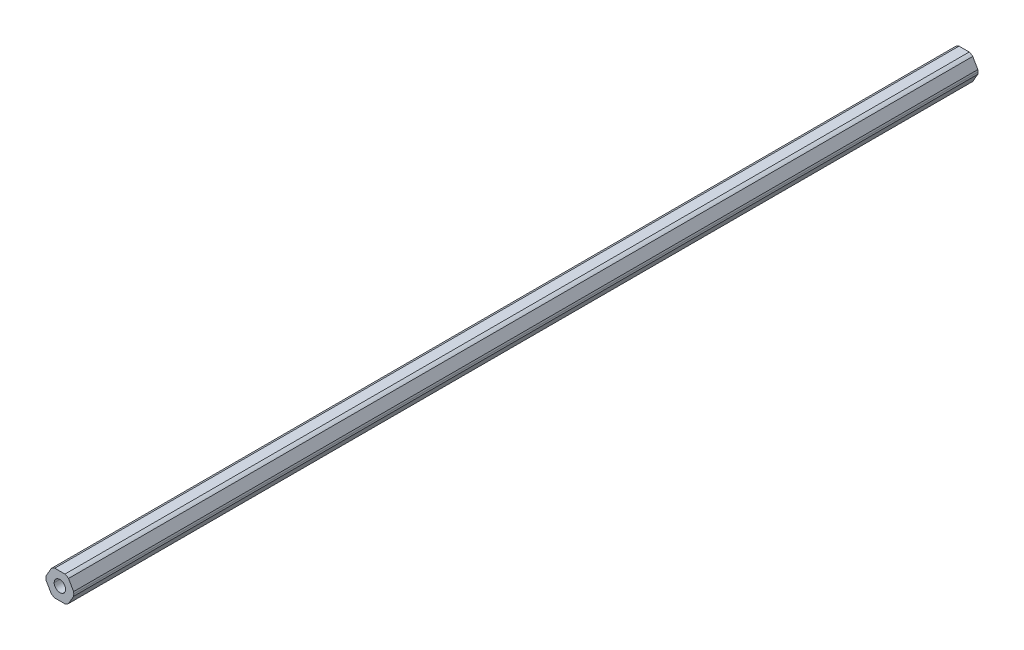
ISO-10303-21;
HEADER;
FILE_DESCRIPTION(('STEP AP214'),'2;1');
FILE_NAME('part.step','',(''),(''),'','','');
FILE_SCHEMA(('AUTOMOTIVE_DESIGN { 1 0 10303 214 1 1 1 1 }'));
ENDSEC;
DATA;
#1=APPLICATION_CONTEXT('core data for automotive mechanical design processes');
#2=APPLICATION_PROTOCOL_DEFINITION('international standard','automotive_design',2000,#1);
#3=PRODUCT_CONTEXT('',#1,'mechanical');
#4=PRODUCT('Part','Part','',(#3));
#5=PRODUCT_RELATED_PRODUCT_CATEGORY('part','',(#4));
#6=PRODUCT_DEFINITION_FORMATION('','',#4);
#7=PRODUCT_DEFINITION_CONTEXT('part definition',#1,'design');
#8=PRODUCT_DEFINITION('design','',#6,#7);
#9=PRODUCT_DEFINITION_SHAPE('','',#8);
#10=(LENGTH_UNIT() NAMED_UNIT(*) SI_UNIT(.MILLI.,.METRE.));
#11=(NAMED_UNIT(*) PLANE_ANGLE_UNIT() SI_UNIT($,.RADIAN.));
#12=(NAMED_UNIT(*) SI_UNIT($,.STERADIAN.) SOLID_ANGLE_UNIT());
#13=UNCERTAINTY_MEASURE_WITH_UNIT(LENGTH_MEASURE(1.E-05),#10,'distance_accuracy_value','');
#14=(GEOMETRIC_REPRESENTATION_CONTEXT(3) GLOBAL_UNCERTAINTY_ASSIGNED_CONTEXT((#13)) GLOBAL_UNIT_ASSIGNED_CONTEXT((#10,
#11,#12)) REPRESENTATION_CONTEXT('',''));
#15=CARTESIAN_POINT('',(0.,0.,0.));
#16=DIRECTION('',(0.,0.,1.));
#17=DIRECTION('',(1.,0.,0.));
#18=AXIS2_PLACEMENT_3D('',#15,#16,#17);
#19=CARTESIAN_POINT('',(0.,0.,-457.2));
#20=DIRECTION('',(0.,0.,1.));
#21=DIRECTION('',(1.,0.,0.));
#22=AXIS2_PLACEMENT_3D('',#19,#20,#21);
#23=CYLINDRICAL_SURFACE('',#22,2.1);
#24=CARTESIAN_POINT('',(0.,0.,-123.825));
#25=DIRECTION('',(0.,0.,1.));
#26=DIRECTION('',(1.,0.,0.));
#27=AXIS2_PLACEMENT_3D('',#24,#25,#26);
#28=CIRCLE('',#27,2.1);
#29=CARTESIAN_POINT('',(2.1,0.,-123.825));
#30=VERTEX_POINT('',#29);
#31=CARTESIAN_POINT('',(-2.1,0.,-123.825));
#32=VERTEX_POINT('',#31);
#33=EDGE_CURVE('E75',#30,#32,#28,.F.);
#34=ORIENTED_EDGE('',*,*,#33,.F.);
#35=DIRECTION('',(0.,0.,1.));
#36=VECTOR('',#35,1.);
#37=CARTESIAN_POINT('',(2.1,0.,-457.2));
#38=LINE('',#37,#36);
#39=CARTESIAN_POINT('',(2.1,0.,-457.2));
#40=VERTEX_POINT('',#39);
#41=EDGE_CURVE('E221',#40,#30,#38,.T.);
#42=ORIENTED_EDGE('',*,*,#41,.F.);
#43=CARTESIAN_POINT('',(0.,0.,-457.2));
#44=DIRECTION('',(0.,0.,1.));
#45=DIRECTION('',(1.,0.,0.));
#46=AXIS2_PLACEMENT_3D('',#43,#44,#45);
#47=CIRCLE('',#46,2.1);
#48=CARTESIAN_POINT('',(-2.1,0.,-457.2));
#49=VERTEX_POINT('',#48);
#50=EDGE_CURVE('E201',#49,#40,#47,.T.);
#51=ORIENTED_EDGE('',*,*,#50,.F.);
#52=DIRECTION('',(0.,0.,1.));
#53=VECTOR('',#52,1.);
#54=CARTESIAN_POINT('',(-2.1,0.,-457.2));
#55=LINE('',#54,#53);
#56=EDGE_CURVE('E62',#49,#32,#55,.T.);
#57=ORIENTED_EDGE('',*,*,#56,.T.);
#58=EDGE_LOOP('',(#34,#42,#51,#57));
#59=FACE_BOUND('',#58,.T.);
#60=ADVANCED_FACE('F54',(#59),#23,.F.);
#61=CARTESIAN_POINT('',(0.,0.,-457.2));
#62=DIRECTION('',(0.,0.,1.));
#63=DIRECTION('',(1.,0.,0.));
#64=AXIS2_PLACEMENT_3D('',#61,#62,#63);
#65=CYLINDRICAL_SURFACE('',#64,5.12);
#66=DIRECTION('',(0.,0.,1.));
#67=VECTOR('',#66,1.);
#68=CARTESIAN_POINT('',(5.12,0.,-457.2));
#69=LINE('',#68,#67);
#70=CARTESIAN_POINT('',(5.12,0.,-457.2));
#71=VERTEX_POINT('',#70);
#72=CARTESIAN_POINT('',(5.12,0.,-123.825));
#73=VERTEX_POINT('',#72);
#74=EDGE_CURVE('E237',#71,#73,#69,.T.);
#75=ORIENTED_EDGE('',*,*,#74,.T.);
#76=CARTESIAN_POINT('',(0.,0.,-123.825));
#77=DIRECTION('',(0.,0.,1.));
#78=DIRECTION('',(1.,0.,0.));
#79=AXIS2_PLACEMENT_3D('',#76,#77,#78);
#80=CIRCLE('',#79,5.12);
#81=CARTESIAN_POINT('',(5.06425896558911,-0.753446168913433,-123.825));
#82=VERTEX_POINT('',#81);
#83=EDGE_CURVE('E176',#82,#73,#80,.T.);
#84=ORIENTED_EDGE('',*,*,#83,.F.);
#85=DIRECTION('',(0.,0.,-1.));
#86=VECTOR('',#85,1.);
#87=CARTESIAN_POINT('',(5.06425896558911,-0.753446168913433,-457.2));
#88=LINE('',#87,#86);
#89=CARTESIAN_POINT('',(5.06425896558911,-0.753446168913433,-457.2));
#90=VERTEX_POINT('',#89);
#91=EDGE_CURVE('E240',#82,#90,#88,.T.);
#92=ORIENTED_EDGE('',*,*,#91,.T.);
#93=CARTESIAN_POINT('',(0.,0.,-457.2));
#94=DIRECTION('',(0.,0.,1.));
#95=DIRECTION('',(1.,0.,0.));
#96=AXIS2_PLACEMENT_3D('',#93,#94,#95);
#97=CIRCLE('',#96,5.12);
#98=EDGE_CURVE('E239',#90,#71,#97,.T.);
#99=ORIENTED_EDGE('',*,*,#98,.T.);
#100=EDGE_LOOP('',(#75,#84,#92,#99));
#101=FACE_BOUND('',#100,.T.);
#102=ADVANCED_FACE('F364',(#101),#65,.T.);
#103=CARTESIAN_POINT('',(2.74963065701564,-4.7625,457.2));
#104=DIRECTION('',(-0.866025403784442,0.5,0.));
#105=DIRECTION('',(0.,0.,1.));
#106=AXIS2_PLACEMENT_3D('',#103,#104,#105);
#107=PLANE('',#106);
#108=DIRECTION('',(0.499999999999991,0.866025403784444,0.));
#109=VECTOR('',#108,1.);
#110=CARTESIAN_POINT('',(3.18463300545771,-4.00905383108654,-123.825));
#111=LINE('',#110,#109);
#112=CARTESIAN_POINT('',(3.18463300545771,-4.00905383108654,-123.825));
#113=VERTEX_POINT('',#112);
#114=EDGE_CURVE('E323',#113,#82,#111,.T.);
#115=ORIENTED_EDGE('',*,*,#114,.F.);
#116=DIRECTION('',(0.,0.,1.));
#117=VECTOR('',#116,1.);
#118=CARTESIAN_POINT('',(3.1846330054577,-4.00905383108652,-457.2));
#119=LINE('',#118,#117);
#120=CARTESIAN_POINT('',(3.1846330054577,-4.00905383108652,-457.2));
#121=VERTEX_POINT('',#120);
#122=EDGE_CURVE('E195',#121,#113,#119,.T.);
#123=ORIENTED_EDGE('',*,*,#122,.F.);
#124=DIRECTION('',(0.5,0.866025403784442,0.));
#125=VECTOR('',#124,1.);
#126=CARTESIAN_POINT('',(2.74963065701564,-4.7625,-457.2));
#127=LINE('',#126,#125);
#128=EDGE_CURVE('E250',#121,#90,#127,.T.);
#129=ORIENTED_EDGE('',*,*,#128,.T.);
#130=ORIENTED_EDGE('',*,*,#91,.F.);
#131=EDGE_LOOP('',(#115,#123,#129,#130));
#132=FACE_BOUND('',#131,.T.);
#133=ADVANCED_FACE('F361',(#132),#107,.F.);
#134=CARTESIAN_POINT('',(5.49926131403117,0.,457.2));
#135=DIRECTION('',(-0.866025403784438,-0.5,0.));
#136=DIRECTION('',(-0.5,0.866025403784438,0.));
#137=AXIS2_PLACEMENT_3D('',#134,#135,#136);
#138=PLANE('',#137);
#139=DIRECTION('',(-0.500000000000001,0.866025403784438,0.));
#140=VECTOR('',#139,1.);
#141=CARTESIAN_POINT('',(5.06425896558911,0.753446168913416,-123.825));
#142=LINE('',#141,#140);
#143=CARTESIAN_POINT('',(5.06425896558911,0.753446168913416,-123.825));
#144=VERTEX_POINT('',#143);
#145=CARTESIAN_POINT('',(3.18463300545762,4.00905383108658,-123.825));
#146=VERTEX_POINT('',#145);
#147=EDGE_CURVE('E69',#144,#146,#142,.T.);
#148=ORIENTED_EDGE('',*,*,#147,.F.);
#149=DIRECTION('',(0.,0.,1.));
#150=VECTOR('',#149,1.);
#151=CARTESIAN_POINT('',(5.06425896558911,0.753446168913412,-457.2));
#152=LINE('',#151,#150);
#153=CARTESIAN_POINT('',(5.06425896558911,0.753446168913416,-457.2));
#154=VERTEX_POINT('',#153);
#155=EDGE_CURVE('E185',#154,#144,#152,.T.);
#156=ORIENTED_EDGE('',*,*,#155,.F.);
#157=DIRECTION('',(-0.5,0.866025403784438,0.));
#158=VECTOR('',#157,1.);
#159=CARTESIAN_POINT('',(5.49926131403117,0.,-457.2));
#160=LINE('',#159,#158);
#161=CARTESIAN_POINT('',(3.18463300545762,4.00905383108658,-457.2));
#162=VERTEX_POINT('',#161);
#163=EDGE_CURVE('E231',#154,#162,#160,.T.);
#164=ORIENTED_EDGE('',*,*,#163,.T.);
#165=DIRECTION('',(0.,0.,-1.));
#166=VECTOR('',#165,1.);
#167=CARTESIAN_POINT('',(3.18463300545762,4.00905383108658,-457.2));
#168=LINE('',#167,#166);
#169=EDGE_CURVE('E187',#146,#162,#168,.T.);
#170=ORIENTED_EDGE('',*,*,#169,.F.);
#171=EDGE_LOOP('',(#148,#156,#164,#170));
#172=FACE_BOUND('',#171,.T.);
#173=ADVANCED_FACE('F183',(#172),#138,.F.);
#174=CARTESIAN_POINT('',(2.74963065701557,4.7625,457.2));
#175=DIRECTION('',(0.,-1.,0.));
#176=DIRECTION('',(0.,0.,-1.));
#177=AXIS2_PLACEMENT_3D('',#174,#175,#176);
#178=PLANE('',#177);
#179=DIRECTION('',(-1.,0.,0.));
#180=VECTOR('',#179,1.);
#181=CARTESIAN_POINT('',(1.87962596013146,4.76249999999999,-123.825));
#182=LINE('',#181,#180);
#183=CARTESIAN_POINT('',(1.87962596013146,4.76249999999999,-123.825));
#184=VERTEX_POINT('',#183);
#185=CARTESIAN_POINT('',(-1.8796259601315,4.7625,-123.825));
#186=VERTEX_POINT('',#185);
#187=EDGE_CURVE('E338',#184,#186,#182,.T.);
#188=ORIENTED_EDGE('',*,*,#187,.F.);
#189=DIRECTION('',(0.,0.,1.));
#190=VECTOR('',#189,1.);
#191=CARTESIAN_POINT('',(1.87962596013147,4.7625,-457.2));
#192=LINE('',#191,#190);
#193=CARTESIAN_POINT('',(1.87962596013147,4.7625,-457.2));
#194=VERTEX_POINT('',#193);
#195=EDGE_CURVE('E212',#194,#184,#192,.T.);
#196=ORIENTED_EDGE('',*,*,#195,.F.);
#197=DIRECTION('',(-1.,0.,0.));
#198=VECTOR('',#197,1.);
#199=CARTESIAN_POINT('',(2.74963065701557,4.7625,-457.2));
#200=LINE('',#199,#198);
#201=CARTESIAN_POINT('',(-1.8796259601315,4.7625,-457.2));
#202=VERTEX_POINT('',#201);
#203=EDGE_CURVE('E265',#194,#202,#200,.T.);
#204=ORIENTED_EDGE('',*,*,#203,.T.);
#205=DIRECTION('',(0.,0.,-1.));
#206=VECTOR('',#205,1.);
#207=CARTESIAN_POINT('',(-1.8796259601315,4.7625,-457.2));
#208=LINE('',#207,#206);
#209=EDGE_CURVE('E259',#186,#202,#208,.T.);
#210=ORIENTED_EDGE('',*,*,#209,.F.);
#211=EDGE_LOOP('',(#188,#196,#204,#210));
#212=FACE_BOUND('',#211,.T.);
#213=ADVANCED_FACE('F344',(#212),#178,.F.);
#214=CARTESIAN_POINT('',(-2.7496306570156,4.7625,457.2));
#215=DIRECTION('',(0.866025403784442,-0.5,0.));
#216=DIRECTION('',(0.,0.,-1.));
#217=AXIS2_PLACEMENT_3D('',#214,#215,#216);
#218=PLANE('',#217);
#219=DIRECTION('',(-0.499999999999993,-0.866025403784443,0.));
#220=VECTOR('',#219,1.);
#221=CARTESIAN_POINT('',(-3.18463300545766,4.00905383108656,-123.825));
#222=LINE('',#221,#220);
#223=CARTESIAN_POINT('',(-3.18463300545767,4.00905383108657,-123.825));
#224=VERTEX_POINT('',#223);
#225=CARTESIAN_POINT('',(-5.06425896558912,0.753446168913382,-123.825));
#226=VERTEX_POINT('',#225);
#227=EDGE_CURVE('E334',#224,#226,#222,.T.);
#228=ORIENTED_EDGE('',*,*,#227,.F.);
#229=DIRECTION('',(0.,0.,1.));
#230=VECTOR('',#229,1.);
#231=CARTESIAN_POINT('',(-3.18463300545766,4.00905383108655,-457.2));
#232=LINE('',#231,#230);
#233=CARTESIAN_POINT('',(-3.18463300545766,4.00905383108655,-457.2));
#234=VERTEX_POINT('',#233);
#235=EDGE_CURVE('E218',#234,#224,#232,.T.);
#236=ORIENTED_EDGE('',*,*,#235,.F.);
#237=DIRECTION('',(-0.5,-0.866025403784442,0.));
#238=VECTOR('',#237,1.);
#239=CARTESIAN_POINT('',(-2.7496306570156,4.7625,-457.2));
#240=LINE('',#239,#238);
#241=CARTESIAN_POINT('',(-5.06425896558912,0.753446168913382,-457.2));
#242=VERTEX_POINT('',#241);
#243=EDGE_CURVE('E262',#234,#242,#240,.T.);
#244=ORIENTED_EDGE('',*,*,#243,.T.);
#245=DIRECTION('',(0.,0.,-1.));
#246=VECTOR('',#245,1.);
#247=CARTESIAN_POINT('',(-5.06425896558912,0.753446168913382,-457.2));
#248=LINE('',#247,#246);
#249=EDGE_CURVE('E249',#226,#242,#248,.T.);
#250=ORIENTED_EDGE('',*,*,#249,.F.);
#251=EDGE_LOOP('',(#228,#236,#244,#250));
#252=FACE_BOUND('',#251,.T.);
#253=ADVANCED_FACE('F277',(#252),#218,.F.);
#254=CARTESIAN_POINT('',(-5.49926131403117,0.,457.2));
#255=DIRECTION('',(0.866025403784435,0.500000000000007,0.));
#256=DIRECTION('',(0.,0.,-1.));
#257=AXIS2_PLACEMENT_3D('',#254,#255,#256);
#258=PLANE('',#257);
#259=DIRECTION('',(0.500000000000007,-0.866025403784435,0.));
#260=VECTOR('',#259,1.);
#261=CARTESIAN_POINT('',(-5.06425896558911,-0.753446168913448,-123.825));
#262=LINE('',#261,#260);
#263=CARTESIAN_POINT('',(-5.06425896558911,-0.753446168913446,-123.825));
#264=VERTEX_POINT('',#263);
#265=CARTESIAN_POINT('',(-3.1846330054576,-4.0090538310866,-123.825));
#266=VERTEX_POINT('',#265);
#267=EDGE_CURVE('E331',#264,#266,#262,.T.);
#268=ORIENTED_EDGE('',*,*,#267,.F.);
#269=DIRECTION('',(0.,0.,1.));
#270=VECTOR('',#269,1.);
#271=CARTESIAN_POINT('',(-5.06425896558911,-0.75344616891345,-457.2));
#272=LINE('',#271,#270);
#273=CARTESIAN_POINT('',(-5.06425896558911,-0.75344616891345,-457.2));
#274=VERTEX_POINT('',#273);
#275=EDGE_CURVE('E257',#274,#264,#272,.T.);
#276=ORIENTED_EDGE('',*,*,#275,.F.);
#277=DIRECTION('',(0.500000000000007,-0.866025403784435,0.));
#278=VECTOR('',#277,1.);
#279=CARTESIAN_POINT('',(-5.49926131403117,0.,-457.2));
#280=LINE('',#279,#278);
#281=CARTESIAN_POINT('',(-3.1846330054576,-4.0090538310866,-457.2));
#282=VERTEX_POINT('',#281);
#283=EDGE_CURVE('E266',#274,#282,#280,.T.);
#284=ORIENTED_EDGE('',*,*,#283,.T.);
#285=DIRECTION('',(0.,0.,-1.));
#286=VECTOR('',#285,1.);
#287=CARTESIAN_POINT('',(-3.1846330054576,-4.0090538310866,-457.2));
#288=LINE('',#287,#286);
#289=EDGE_CURVE('E233',#266,#282,#288,.T.);
#290=ORIENTED_EDGE('',*,*,#289,.F.);
#291=EDGE_LOOP('',(#268,#276,#284,#290));
#292=FACE_BOUND('',#291,.T.);
#293=ADVANCED_FACE('F350',(#292),#258,.F.);
#294=CARTESIAN_POINT('',(-2.74963065701554,-4.7625,457.2));
#295=DIRECTION('',(0.,1.,0.));
#296=DIRECTION('',(1.,0.,0.));
#297=AXIS2_PLACEMENT_3D('',#294,#295,#296);
#298=PLANE('',#297);
#299=DIRECTION('',(1.,0.,0.));
#300=VECTOR('',#299,1.);
#301=CARTESIAN_POINT('',(-1.87962596013144,-4.7625,-123.825));
#302=LINE('',#301,#300);
#303=CARTESIAN_POINT('',(-1.87962596013144,-4.7625,-123.825));
#304=VERTEX_POINT('',#303);
#305=CARTESIAN_POINT('',(1.87962596013154,-4.7625,-123.825));
#306=VERTEX_POINT('',#305);
#307=EDGE_CURVE('E327',#304,#306,#302,.T.);
#308=ORIENTED_EDGE('',*,*,#307,.F.);
#309=DIRECTION('',(0.,0.,1.));
#310=VECTOR('',#309,1.);
#311=CARTESIAN_POINT('',(-1.87962596013144,-4.7625,-457.2));
#312=LINE('',#311,#310);
#313=CARTESIAN_POINT('',(-1.87962596013144,-4.7625,-457.2));
#314=VERTEX_POINT('',#313);
#315=EDGE_CURVE('E245',#314,#304,#312,.T.);
#316=ORIENTED_EDGE('',*,*,#315,.F.);
#317=DIRECTION('',(1.,0.,0.));
#318=VECTOR('',#317,1.);
#319=CARTESIAN_POINT('',(-2.74963065701554,-4.7625,-457.2));
#320=LINE('',#319,#318);
#321=CARTESIAN_POINT('',(1.87962596013154,-4.7625,-457.2));
#322=VERTEX_POINT('',#321);
#323=EDGE_CURVE('E290',#314,#322,#320,.T.);
#324=ORIENTED_EDGE('',*,*,#323,.T.);
#325=DIRECTION('',(0.,0.,-1.));
#326=VECTOR('',#325,1.);
#327=CARTESIAN_POINT('',(1.87962596013154,-4.7625,-457.2));
#328=LINE('',#327,#326);
#329=EDGE_CURVE('E205',#306,#322,#328,.T.);
#330=ORIENTED_EDGE('',*,*,#329,.F.);
#331=EDGE_LOOP('',(#308,#316,#324,#330));
#332=FACE_BOUND('',#331,.T.);
#333=ADVANCED_FACE('F355',(#332),#298,.F.);
#334=CARTESIAN_POINT('',(0.,0.,-457.2));
#335=DIRECTION('',(0.,0.,1.));
#336=DIRECTION('',(1.,0.,0.));
#337=AXIS2_PLACEMENT_3D('',#334,#335,#336);
#338=CYLINDRICAL_SURFACE('',#337,5.12);
#339=ORIENTED_EDGE('',*,*,#155,.T.);
#340=EDGE_CURVE('E173',#73,#144,#80,.T.);
#341=ORIENTED_EDGE('',*,*,#340,.F.);
#342=ORIENTED_EDGE('',*,*,#74,.F.);
#343=CARTESIAN_POINT('',(0.,0.,-457.2));
#344=DIRECTION('',(0.,0.,1.));
#345=DIRECTION('',(1.,0.,0.));
#346=AXIS2_PLACEMENT_3D('',#343,#344,#345);
#347=CIRCLE('',#346,5.12);
#348=EDGE_CURVE('E193',#71,#154,#347,.T.);
#349=ORIENTED_EDGE('',*,*,#348,.T.);
#350=EDGE_LOOP('',(#339,#341,#342,#349));
#351=FACE_BOUND('',#350,.T.);
#352=ADVANCED_FACE('F191',(#351),#338,.T.);
#353=CARTESIAN_POINT('',(0.,0.,-457.2));
#354=DIRECTION('',(0.,0.,1.));
#355=DIRECTION('',(1.,0.,0.));
#356=AXIS2_PLACEMENT_3D('',#353,#354,#355);
#357=CYLINDRICAL_SURFACE('',#356,5.12);
#358=ORIENTED_EDGE('',*,*,#122,.T.);
#359=CARTESIAN_POINT('',(0.,0.,-123.825));
#360=DIRECTION('',(0.,0.,1.));
#361=DIRECTION('',(1.,0.,0.));
#362=AXIS2_PLACEMENT_3D('',#359,#360,#361);
#363=CIRCLE('',#362,5.12000000000003);
#364=EDGE_CURVE('E325',#306,#113,#363,.T.);
#365=ORIENTED_EDGE('',*,*,#364,.F.);
#366=ORIENTED_EDGE('',*,*,#329,.T.);
#367=CARTESIAN_POINT('',(0.,0.,-457.2));
#368=DIRECTION('',(0.,0.,1.));
#369=DIRECTION('',(1.,0.,0.));
#370=AXIS2_PLACEMENT_3D('',#367,#368,#369);
#371=CIRCLE('',#370,5.12);
#372=EDGE_CURVE('E235',#322,#121,#371,.T.);
#373=ORIENTED_EDGE('',*,*,#372,.T.);
#374=EDGE_LOOP('',(#358,#365,#366,#373));
#375=FACE_BOUND('',#374,.T.);
#376=ADVANCED_FACE('F362',(#375),#357,.T.);
#377=CARTESIAN_POINT('',(0.,0.,-457.2));
#378=DIRECTION('',(0.,0.,1.));
#379=DIRECTION('',(1.,0.,0.));
#380=AXIS2_PLACEMENT_3D('',#377,#378,#379);
#381=CYLINDRICAL_SURFACE('',#380,5.12);
#382=ORIENTED_EDGE('',*,*,#315,.T.);
#383=CARTESIAN_POINT('',(0.,0.,-123.825));
#384=DIRECTION('',(0.,0.,1.));
#385=DIRECTION('',(1.,0.,0.));
#386=AXIS2_PLACEMENT_3D('',#383,#384,#385);
#387=CIRCLE('',#386,5.12);
#388=EDGE_CURVE('E329',#266,#304,#387,.T.);
#389=ORIENTED_EDGE('',*,*,#388,.F.);
#390=ORIENTED_EDGE('',*,*,#289,.T.);
#391=CARTESIAN_POINT('',(0.,0.,-457.2));
#392=DIRECTION('',(0.,0.,1.));
#393=DIRECTION('',(1.,0.,0.));
#394=AXIS2_PLACEMENT_3D('',#391,#392,#393);
#395=CIRCLE('',#394,5.12);
#396=EDGE_CURVE('E236',#282,#314,#395,.T.);
#397=ORIENTED_EDGE('',*,*,#396,.T.);
#398=EDGE_LOOP('',(#382,#389,#390,#397));
#399=FACE_BOUND('',#398,.T.);
#400=ADVANCED_FACE('F352',(#399),#381,.T.);
#401=CARTESIAN_POINT('',(0.,0.,-457.2));
#402=DIRECTION('',(0.,0.,1.));
#403=DIRECTION('',(1.,0.,0.));
#404=AXIS2_PLACEMENT_3D('',#401,#402,#403);
#405=CYLINDRICAL_SURFACE('',#404,5.12);
#406=ORIENTED_EDGE('',*,*,#275,.T.);
#407=CARTESIAN_POINT('',(0.,0.,-123.825));
#408=DIRECTION('',(0.,0.,1.));
#409=DIRECTION('',(1.,0.,0.));
#410=AXIS2_PLACEMENT_3D('',#407,#408,#409);
#411=CIRCLE('',#410,5.12);
#412=EDGE_CURVE('E273',#226,#264,#411,.T.);
#413=ORIENTED_EDGE('',*,*,#412,.F.);
#414=ORIENTED_EDGE('',*,*,#249,.T.);
#415=CARTESIAN_POINT('',(0.,0.,-457.2));
#416=DIRECTION('',(0.,0.,1.));
#417=DIRECTION('',(1.,0.,0.));
#418=AXIS2_PLACEMENT_3D('',#415,#416,#417);
#419=CIRCLE('',#418,5.12);
#420=EDGE_CURVE('E254',#242,#274,#419,.T.);
#421=ORIENTED_EDGE('',*,*,#420,.T.);
#422=EDGE_LOOP('',(#406,#413,#414,#421));
#423=FACE_BOUND('',#422,.T.);
#424=ADVANCED_FACE('F271',(#423),#405,.T.);
#425=CARTESIAN_POINT('',(0.,0.,-457.2));
#426=DIRECTION('',(0.,0.,1.));
#427=DIRECTION('',(1.,0.,0.));
#428=AXIS2_PLACEMENT_3D('',#425,#426,#427);
#429=CYLINDRICAL_SURFACE('',#428,5.12);
#430=ORIENTED_EDGE('',*,*,#235,.T.);
#431=CARTESIAN_POINT('',(0.,0.,-123.825));
#432=DIRECTION('',(0.,0.,1.));
#433=DIRECTION('',(1.,0.,0.));
#434=AXIS2_PLACEMENT_3D('',#431,#432,#433);
#435=CIRCLE('',#434,5.12000000000002);
#436=EDGE_CURVE('E336',#186,#224,#435,.T.);
#437=ORIENTED_EDGE('',*,*,#436,.F.);
#438=ORIENTED_EDGE('',*,*,#209,.T.);
#439=CARTESIAN_POINT('',(0.,0.,-457.2));
#440=DIRECTION('',(0.,0.,1.));
#441=DIRECTION('',(1.,0.,0.));
#442=AXIS2_PLACEMENT_3D('',#439,#440,#441);
#443=CIRCLE('',#442,5.12);
#444=EDGE_CURVE('E244',#202,#234,#443,.T.);
#445=ORIENTED_EDGE('',*,*,#444,.T.);
#446=EDGE_LOOP('',(#430,#437,#438,#445));
#447=FACE_BOUND('',#446,.T.);
#448=ADVANCED_FACE('F347',(#447),#429,.T.);
#449=CARTESIAN_POINT('',(0.,0.,-457.2));
#450=DIRECTION('',(0.,0.,1.));
#451=DIRECTION('',(1.,0.,0.));
#452=AXIS2_PLACEMENT_3D('',#449,#450,#451);
#453=CYLINDRICAL_SURFACE('',#452,5.12);
#454=ORIENTED_EDGE('',*,*,#195,.T.);
#455=CARTESIAN_POINT('',(0.,0.,-123.825));
#456=DIRECTION('',(0.,0.,1.));
#457=DIRECTION('',(1.,0.,0.));
#458=AXIS2_PLACEMENT_3D('',#455,#456,#457);
#459=CIRCLE('',#458,5.12);
#460=EDGE_CURVE('E188',#146,#184,#459,.T.);
#461=ORIENTED_EDGE('',*,*,#460,.F.);
#462=ORIENTED_EDGE('',*,*,#169,.T.);
#463=CARTESIAN_POINT('',(0.,0.,-457.2));
#464=DIRECTION('',(0.,0.,1.));
#465=DIRECTION('',(1.,0.,0.));
#466=AXIS2_PLACEMENT_3D('',#463,#464,#465);
#467=CIRCLE('',#466,5.12);
#468=EDGE_CURVE('E210',#162,#194,#467,.T.);
#469=ORIENTED_EDGE('',*,*,#468,.T.);
#470=EDGE_LOOP('',(#454,#461,#462,#469));
#471=FACE_BOUND('',#470,.T.);
#472=ADVANCED_FACE('F379',(#471),#453,.T.);
#473=CARTESIAN_POINT('',(0.,0.,-457.2));
#474=DIRECTION('',(0.,0.,1.));
#475=DIRECTION('',(1.,0.,0.));
#476=AXIS2_PLACEMENT_3D('',#473,#474,#475);
#477=CYLINDRICAL_SURFACE('',#476,2.1);
#478=CARTESIAN_POINT('',(0.,0.,-123.825));
#479=DIRECTION('',(0.,0.,1.));
#480=DIRECTION('',(1.,0.,0.));
#481=AXIS2_PLACEMENT_3D('',#478,#479,#480);
#482=CIRCLE('',#481,2.1);
#483=EDGE_CURVE('E13',#32,#30,#482,.F.);
#484=ORIENTED_EDGE('',*,*,#483,.F.);
#485=ORIENTED_EDGE('',*,*,#56,.F.);
#486=CARTESIAN_POINT('',(0.,0.,-457.2));
#487=DIRECTION('',(0.,0.,1.));
#488=DIRECTION('',(1.,0.,0.));
#489=AXIS2_PLACEMENT_3D('',#486,#487,#488);
#490=CIRCLE('',#489,2.1);
#491=EDGE_CURVE('E208',#40,#49,#490,.T.);
#492=ORIENTED_EDGE('',*,*,#491,.F.);
#493=ORIENTED_EDGE('',*,*,#41,.T.);
#494=EDGE_LOOP('',(#484,#485,#492,#493));
#495=FACE_BOUND('',#494,.T.);
#496=ADVANCED_FACE('F395',(#495),#477,.F.);
#497=CARTESIAN_POINT('',(0.,0.,-457.2));
#498=DIRECTION('',(0.,0.,1.));
#499=DIRECTION('',(1.,0.,0.));
#500=AXIS2_PLACEMENT_3D('',#497,#498,#499);
#501=PLANE('',#500);
#502=ORIENTED_EDGE('',*,*,#468,.F.);
#503=ORIENTED_EDGE('',*,*,#163,.F.);
#504=ORIENTED_EDGE('',*,*,#348,.F.);
#505=ORIENTED_EDGE('',*,*,#98,.F.);
#506=ORIENTED_EDGE('',*,*,#128,.F.);
#507=ORIENTED_EDGE('',*,*,#372,.F.);
#508=ORIENTED_EDGE('',*,*,#323,.F.);
#509=ORIENTED_EDGE('',*,*,#396,.F.);
#510=ORIENTED_EDGE('',*,*,#283,.F.);
#511=ORIENTED_EDGE('',*,*,#420,.F.);
#512=ORIENTED_EDGE('',*,*,#243,.F.);
#513=ORIENTED_EDGE('',*,*,#444,.F.);
#514=ORIENTED_EDGE('',*,*,#203,.F.);
#515=EDGE_LOOP('',(#502,#503,#504,#505,#506,#507,#508,#509,#510,#511,#512,#513,#514));
#516=FACE_BOUND('',#515,.T.);
#517=ORIENTED_EDGE('',*,*,#491,.T.);
#518=ORIENTED_EDGE('',*,*,#50,.T.);
#519=EDGE_LOOP('',(#517,#518));
#520=FACE_BOUND('',#519,.T.);
#521=ADVANCED_FACE('F56',(#516,#520),#501,.F.);
#522=CARTESIAN_POINT('',(0.,0.,-123.825));
#523=DIRECTION('',(0.,0.,1.));
#524=DIRECTION('',(1.,0.,0.));
#525=AXIS2_PLACEMENT_3D('',#522,#523,#524);
#526=PLANE('',#525);
#527=ORIENTED_EDGE('',*,*,#83,.T.);
#528=ORIENTED_EDGE('',*,*,#340,.T.);
#529=ORIENTED_EDGE('',*,*,#147,.T.);
#530=ORIENTED_EDGE('',*,*,#460,.T.);
#531=ORIENTED_EDGE('',*,*,#187,.T.);
#532=ORIENTED_EDGE('',*,*,#436,.T.);
#533=ORIENTED_EDGE('',*,*,#227,.T.);
#534=ORIENTED_EDGE('',*,*,#412,.T.);
#535=ORIENTED_EDGE('',*,*,#267,.T.);
#536=ORIENTED_EDGE('',*,*,#388,.T.);
#537=ORIENTED_EDGE('',*,*,#307,.T.);
#538=ORIENTED_EDGE('',*,*,#364,.T.);
#539=ORIENTED_EDGE('',*,*,#114,.T.);
#540=EDGE_LOOP('',(#527,#528,#529,#530,#531,#532,#533,#534,#535,#536,#537,#538,#539));
#541=FACE_BOUND('',#540,.T.);
#542=ORIENTED_EDGE('',*,*,#33,.T.);
#543=ORIENTED_EDGE('',*,*,#483,.T.);
#544=EDGE_LOOP('',(#542,#543));
#545=FACE_BOUND('',#544,.T.);
#546=ADVANCED_FACE('F174',(#541,#545),#526,.T.);
#547=CLOSED_SHELL('',(#60,#102,#133,#173,#213,#253,#293,#333,#352,#376,#400,#424,#448,#472,#496,
#521,#546));
#548=MANIFOLD_SOLID_BREP('B2',#547);
#549=ADVANCED_BREP_SHAPE_REPRESENTATION('',(#18,#548),#14);
#550=SHAPE_DEFINITION_REPRESENTATION(#9,#549);
ENDSEC;
END-ISO-10303-21;
